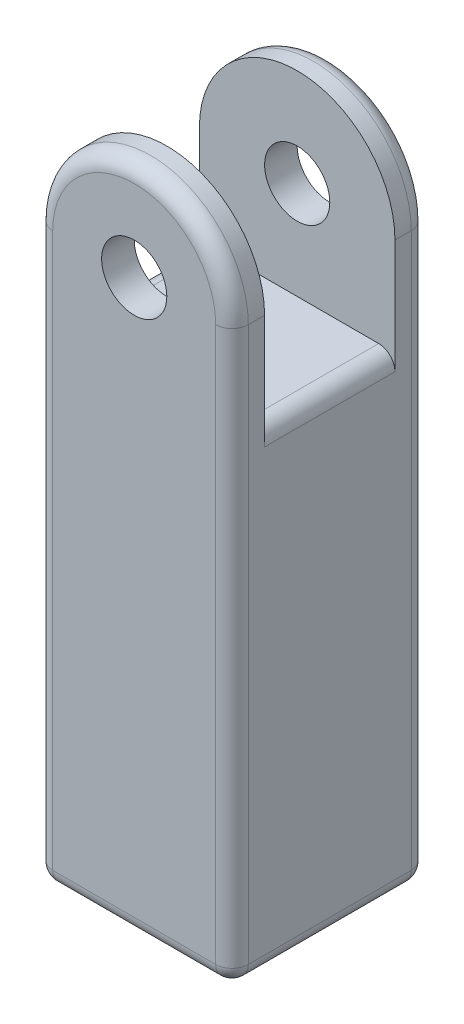
ISO-10303-21;
HEADER;
FILE_DESCRIPTION(('STEP AP214'),'2;1');
FILE_NAME('part.step','',(''),(''),'','','');
FILE_SCHEMA(('AUTOMOTIVE_DESIGN { 1 0 10303 214 1 1 1 1 }'));
ENDSEC;
DATA;
#1=APPLICATION_CONTEXT('core data for automotive mechanical design processes');
#2=APPLICATION_PROTOCOL_DEFINITION('international standard','automotive_design',2000,#1);
#3=PRODUCT_CONTEXT('',#1,'mechanical');
#4=PRODUCT('Part','Part','',(#3));
#5=PRODUCT_RELATED_PRODUCT_CATEGORY('part','',(#4));
#6=PRODUCT_DEFINITION_FORMATION('','',#4);
#7=PRODUCT_DEFINITION_CONTEXT('part definition',#1,'design');
#8=PRODUCT_DEFINITION('design','',#6,#7);
#9=PRODUCT_DEFINITION_SHAPE('','',#8);
#10=(LENGTH_UNIT() NAMED_UNIT(*) SI_UNIT(.MILLI.,.METRE.));
#11=(NAMED_UNIT(*) PLANE_ANGLE_UNIT() SI_UNIT($,.RADIAN.));
#12=(NAMED_UNIT(*) SI_UNIT($,.STERADIAN.) SOLID_ANGLE_UNIT());
#13=UNCERTAINTY_MEASURE_WITH_UNIT(LENGTH_MEASURE(1.E-05),#10,'distance_accuracy_value','');
#14=(GEOMETRIC_REPRESENTATION_CONTEXT(3) GLOBAL_UNCERTAINTY_ASSIGNED_CONTEXT((#13)) GLOBAL_UNIT_ASSIGNED_CONTEXT((#10,
#11,#12)) REPRESENTATION_CONTEXT('',''));
#15=CARTESIAN_POINT('',(0.,0.,0.));
#16=DIRECTION('',(0.,0.,1.));
#17=DIRECTION('',(1.,0.,0.));
#18=AXIS2_PLACEMENT_3D('',#15,#16,#17);
#19=CARTESIAN_POINT('',(0.,175.,-111.394102980499));
#20=DIRECTION('',(0.,0.,1.));
#21=DIRECTION('',(1.,0.,0.));
#22=AXIS2_PLACEMENT_3D('',#19,#20,#21);
#23=CYLINDRICAL_SURFACE('',#22,30.);
#24=DIRECTION('',(0.,0.,1.));
#25=VECTOR('',#24,1.);
#26=CARTESIAN_POINT('',(30.,175.,-111.394102980499));
#27=LINE('',#26,#25);
#28=CARTESIAN_POINT('',(30.,175.,-25.));
#29=VERTEX_POINT('',#28);
#30=CARTESIAN_POINT('',(30.,175.,-20.));
#31=VERTEX_POINT('',#30);
#32=EDGE_CURVE('E175',#29,#31,#27,.T.);
#33=ORIENTED_EDGE('',*,*,#32,.F.);
#34=CARTESIAN_POINT('',(0.,175.,-25.));
#35=DIRECTION('',(0.,0.,1.));
#36=DIRECTION('',(1.,0.,0.));
#37=AXIS2_PLACEMENT_3D('',#34,#35,#36);
#38=CIRCLE('',#37,30.);
#39=CARTESIAN_POINT('',(-30.,175.,-25.));
#40=VERTEX_POINT('',#39);
#41=EDGE_CURVE('E227',#29,#40,#38,.T.);
#42=ORIENTED_EDGE('',*,*,#41,.T.);
#43=DIRECTION('',(0.,0.,1.));
#44=VECTOR('',#43,1.);
#45=CARTESIAN_POINT('',(-30.,175.,-111.394102980499));
#46=LINE('',#45,#44);
#47=CARTESIAN_POINT('',(-30.,175.,-20.));
#48=VERTEX_POINT('',#47);
#49=EDGE_CURVE('E174',#40,#48,#46,.T.);
#50=ORIENTED_EDGE('',*,*,#49,.T.);
#51=CARTESIAN_POINT('',(0.,175.,-20.));
#52=DIRECTION('',(0.,0.,-1.));
#53=DIRECTION('',(-1.,0.,0.));
#54=AXIS2_PLACEMENT_3D('',#51,#52,#53);
#55=CIRCLE('',#54,30.);
#56=EDGE_CURVE('E197',#31,#48,#55,.F.);
#57=ORIENTED_EDGE('',*,*,#56,.F.);
#58=EDGE_LOOP('',(#33,#42,#50,#57));
#59=FACE_BOUND('',#58,.T.);
#60=ADVANCED_FACE('F33',(#59),#23,.T.);
#61=CARTESIAN_POINT('',(0.,175.,-111.394102980499));
#62=DIRECTION('',(0.,0.,1.));
#63=DIRECTION('',(1.,0.,0.));
#64=AXIS2_PLACEMENT_3D('',#61,#62,#63);
#65=CYLINDRICAL_SURFACE('',#64,10.);
#66=CARTESIAN_POINT('',(0.,175.,-20.));
#67=DIRECTION('',(0.,0.,-1.));
#68=DIRECTION('',(-1.,0.,0.));
#69=AXIS2_PLACEMENT_3D('',#66,#67,#68);
#70=CIRCLE('',#69,10.);
#71=CARTESIAN_POINT('',(-10.,175.,-20.));
#72=VERTEX_POINT('',#71);
#73=EDGE_CURVE('E168',#72,#72,#70,.F.);
#74=ORIENTED_EDGE('',*,*,#73,.T.);
#75=EDGE_LOOP('',(#74));
#76=FACE_BOUND('',#75,.T.);
#77=CARTESIAN_POINT('',(0.,175.,-30.));
#78=DIRECTION('',(0.,0.,1.));
#79=DIRECTION('',(1.,0.,0.));
#80=AXIS2_PLACEMENT_3D('',#77,#78,#79);
#81=CIRCLE('',#80,10.);
#82=CARTESIAN_POINT('',(10.,175.,-30.));
#83=VERTEX_POINT('',#82);
#84=EDGE_CURVE('E177',#83,#83,#81,.F.);
#85=ORIENTED_EDGE('',*,*,#84,.T.);
#86=EDGE_LOOP('',(#85));
#87=FACE_BOUND('',#86,.T.);
#88=ADVANCED_FACE('F373',(#76,#87),#65,.F.);
#89=CARTESIAN_POINT('',(30.,150.,-30.));
#90=DIRECTION('',(-1.,0.,0.));
#91=DIRECTION('',(0.,0.,1.));
#92=AXIS2_PLACEMENT_3D('',#89,#90,#91);
#93=PLANE('',#92);
#94=DIRECTION('',(0.,0.,1.));
#95=VECTOR('',#94,1.);
#96=CARTESIAN_POINT('',(30.,140.,-30.));
#97=LINE('',#96,#95);
#98=CARTESIAN_POINT('',(30.,140.,-20.));
#99=VERTEX_POINT('',#98);
#100=CARTESIAN_POINT('',(30.,140.,20.));
#101=VERTEX_POINT('',#100);
#102=EDGE_CURVE('E204',#99,#101,#97,.T.);
#103=ORIENTED_EDGE('',*,*,#102,.T.);
#104=DIRECTION('',(0.,1.,0.));
#105=VECTOR('',#104,1.);
#106=CARTESIAN_POINT('',(30.,205.,20.));
#107=LINE('',#106,#105);
#108=CARTESIAN_POINT('',(30.,175.,20.));
#109=VERTEX_POINT('',#108);
#110=EDGE_CURVE('E308',#101,#109,#107,.T.);
#111=ORIENTED_EDGE('',*,*,#110,.T.);
#112=CARTESIAN_POINT('',(30.,175.,25.));
#113=VERTEX_POINT('',#112);
#114=EDGE_CURVE('E167',#109,#113,#27,.T.);
#115=ORIENTED_EDGE('',*,*,#114,.T.);
#116=DIRECTION('',(0.,-1.,0.));
#117=VECTOR('',#116,1.);
#118=CARTESIAN_POINT('',(30.,150.,25.));
#119=LINE('',#118,#117);
#120=CARTESIAN_POINT('',(30.,5.,25.));
#121=VERTEX_POINT('',#120);
#122=EDGE_CURVE('E201',#113,#121,#119,.T.);
#123=ORIENTED_EDGE('',*,*,#122,.T.);
#124=DIRECTION('',(0.,0.,-1.));
#125=VECTOR('',#124,1.);
#126=CARTESIAN_POINT('',(30.,5.,-30.));
#127=LINE('',#126,#125);
#128=CARTESIAN_POINT('',(30.,5.,-25.));
#129=VERTEX_POINT('',#128);
#130=EDGE_CURVE('E189',#121,#129,#127,.T.);
#131=ORIENTED_EDGE('',*,*,#130,.T.);
#132=DIRECTION('',(0.,-1.,0.));
#133=VECTOR('',#132,1.);
#134=CARTESIAN_POINT('',(30.,150.,-25.));
#135=LINE('',#134,#133);
#136=EDGE_CURVE('E199',#129,#29,#135,.F.);
#137=ORIENTED_EDGE('',*,*,#136,.T.);
#138=ORIENTED_EDGE('',*,*,#32,.T.);
#139=DIRECTION('',(0.,-1.,0.));
#140=VECTOR('',#139,1.);
#141=CARTESIAN_POINT('',(30.,205.,-20.));
#142=LINE('',#141,#140);
#143=EDGE_CURVE('E157',#31,#99,#142,.T.);
#144=ORIENTED_EDGE('',*,*,#143,.T.);
#145=EDGE_LOOP('',(#103,#111,#115,#123,#131,#137,#138,#144));
#146=FACE_BOUND('',#145,.T.);
#147=ADVANCED_FACE('F320',(#146),#93,.F.);
#148=CARTESIAN_POINT('',(-30.,150.,-30.));
#149=DIRECTION('',(0.,0.,1.));
#150=DIRECTION('',(1.,0.,0.));
#151=AXIS2_PLACEMENT_3D('',#148,#149,#150);
#152=PLANE('',#151);
#153=CARTESIAN_POINT('',(0.,175.,-30.));
#154=DIRECTION('',(0.,0.,1.));
#155=DIRECTION('',(1.,0.,0.));
#156=AXIS2_PLACEMENT_3D('',#153,#154,#155);
#157=CIRCLE('',#156,25.);
#158=CARTESIAN_POINT('',(-25.,175.,-30.));
#159=VERTEX_POINT('',#158);
#160=CARTESIAN_POINT('',(25.,175.,-30.));
#161=VERTEX_POINT('',#160);
#162=EDGE_CURVE('E222',#159,#161,#157,.F.);
#163=ORIENTED_EDGE('',*,*,#162,.T.);
#164=DIRECTION('',(0.,-1.,0.));
#165=VECTOR('',#164,1.);
#166=CARTESIAN_POINT('',(25.,150.,-30.));
#167=LINE('',#166,#165);
#168=CARTESIAN_POINT('',(25.,5.,-30.));
#169=VERTEX_POINT('',#168);
#170=EDGE_CURVE('E224',#161,#169,#167,.T.);
#171=ORIENTED_EDGE('',*,*,#170,.T.);
#172=DIRECTION('',(-1.,0.,0.));
#173=VECTOR('',#172,1.);
#174=CARTESIAN_POINT('',(-30.,5.,-30.));
#175=LINE('',#174,#173);
#176=CARTESIAN_POINT('',(-25.,5.,-30.));
#177=VERTEX_POINT('',#176);
#178=EDGE_CURVE('E220',#169,#177,#175,.T.);
#179=ORIENTED_EDGE('',*,*,#178,.T.);
#180=DIRECTION('',(0.,-1.,0.));
#181=VECTOR('',#180,1.);
#182=CARTESIAN_POINT('',(-25.,150.,-30.));
#183=LINE('',#182,#181);
#184=EDGE_CURVE('E218',#177,#159,#183,.F.);
#185=ORIENTED_EDGE('',*,*,#184,.T.);
#186=EDGE_LOOP('',(#163,#171,#179,#185));
#187=FACE_BOUND('',#186,.T.);
#188=ORIENTED_EDGE('',*,*,#84,.F.);
#189=EDGE_LOOP('',(#188));
#190=FACE_BOUND('',#189,.T.);
#191=ADVANCED_FACE('F407',(#187,#190),#152,.F.);
#192=CARTESIAN_POINT('',(-30.,150.,-30.));
#193=DIRECTION('',(1.,0.,0.));
#194=DIRECTION('',(0.,0.,-1.));
#195=AXIS2_PLACEMENT_3D('',#192,#193,#194);
#196=PLANE('',#195);
#197=DIRECTION('',(0.,1.,0.));
#198=VECTOR('',#197,1.);
#199=CARTESIAN_POINT('',(-30.,205.,20.));
#200=LINE('',#199,#198);
#201=CARTESIAN_POINT('',(-30.,140.,20.));
#202=VERTEX_POINT('',#201);
#203=CARTESIAN_POINT('',(-30.,175.,20.));
#204=VERTEX_POINT('',#203);
#205=EDGE_CURVE('E146',#202,#204,#200,.T.);
#206=ORIENTED_EDGE('',*,*,#205,.F.);
#207=DIRECTION('',(0.,0.,1.));
#208=VECTOR('',#207,1.);
#209=CARTESIAN_POINT('',(-30.,140.,-30.));
#210=LINE('',#209,#208);
#211=CARTESIAN_POINT('',(-30.,140.,-20.));
#212=VERTEX_POINT('',#211);
#213=EDGE_CURVE('E243',#202,#212,#210,.F.);
#214=ORIENTED_EDGE('',*,*,#213,.T.);
#215=DIRECTION('',(0.,-1.,0.));
#216=VECTOR('',#215,1.);
#217=CARTESIAN_POINT('',(-30.,205.,-20.));
#218=LINE('',#217,#216);
#219=EDGE_CURVE('E158',#48,#212,#218,.T.);
#220=ORIENTED_EDGE('',*,*,#219,.F.);
#221=ORIENTED_EDGE('',*,*,#49,.F.);
#222=DIRECTION('',(0.,-1.,0.));
#223=VECTOR('',#222,1.);
#224=CARTESIAN_POINT('',(-30.,150.,-25.));
#225=LINE('',#224,#223);
#226=CARTESIAN_POINT('',(-30.,5.,-25.));
#227=VERTEX_POINT('',#226);
#228=EDGE_CURVE('E240',#40,#227,#225,.T.);
#229=ORIENTED_EDGE('',*,*,#228,.T.);
#230=DIRECTION('',(0.,0.,1.));
#231=VECTOR('',#230,1.);
#232=CARTESIAN_POINT('',(-30.,5.,-30.));
#233=LINE('',#232,#231);
#234=CARTESIAN_POINT('',(-30.,5.,25.));
#235=VERTEX_POINT('',#234);
#236=EDGE_CURVE('E238',#227,#235,#233,.T.);
#237=ORIENTED_EDGE('',*,*,#236,.T.);
#238=DIRECTION('',(0.,-1.,0.));
#239=VECTOR('',#238,1.);
#240=CARTESIAN_POINT('',(-30.,150.,25.));
#241=LINE('',#240,#239);
#242=CARTESIAN_POINT('',(-30.,175.,25.));
#243=VERTEX_POINT('',#242);
#244=EDGE_CURVE('E173',#235,#243,#241,.F.);
#245=ORIENTED_EDGE('',*,*,#244,.T.);
#246=EDGE_CURVE('E164',#204,#243,#46,.T.);
#247=ORIENTED_EDGE('',*,*,#246,.F.);
#248=EDGE_LOOP('',(#206,#214,#220,#221,#229,#237,#245,#247));
#249=FACE_BOUND('',#248,.T.);
#250=ADVANCED_FACE('F171',(#249),#196,.F.);
#251=CARTESIAN_POINT('',(-30.,150.,30.));
#252=DIRECTION('',(0.,0.,-1.));
#253=DIRECTION('',(-1.,0.,0.));
#254=AXIS2_PLACEMENT_3D('',#251,#252,#253);
#255=PLANE('',#254);
#256=DIRECTION('',(1.,0.,0.));
#257=VECTOR('',#256,1.);
#258=CARTESIAN_POINT('',(-30.,5.,30.));
#259=LINE('',#258,#257);
#260=CARTESIAN_POINT('',(-25.,5.,30.));
#261=VERTEX_POINT('',#260);
#262=CARTESIAN_POINT('',(25.,5.,30.));
#263=VERTEX_POINT('',#262);
#264=EDGE_CURVE('E209',#261,#263,#259,.T.);
#265=ORIENTED_EDGE('',*,*,#264,.T.);
#266=DIRECTION('',(0.,-1.,0.));
#267=VECTOR('',#266,1.);
#268=CARTESIAN_POINT('',(25.,150.,30.));
#269=LINE('',#268,#267);
#270=CARTESIAN_POINT('',(25.,175.,30.));
#271=VERTEX_POINT('',#270);
#272=EDGE_CURVE('E213',#263,#271,#269,.F.);
#273=ORIENTED_EDGE('',*,*,#272,.T.);
#274=CARTESIAN_POINT('',(0.,175.,30.));
#275=DIRECTION('',(0.,0.,-1.));
#276=DIRECTION('',(-1.,0.,0.));
#277=AXIS2_PLACEMENT_3D('',#274,#275,#276);
#278=CIRCLE('',#277,25.);
#279=CARTESIAN_POINT('',(-25.,175.,30.));
#280=VERTEX_POINT('',#279);
#281=EDGE_CURVE('E211',#271,#280,#278,.F.);
#282=ORIENTED_EDGE('',*,*,#281,.T.);
#283=DIRECTION('',(0.,-1.,0.));
#284=VECTOR('',#283,1.);
#285=CARTESIAN_POINT('',(-25.,150.,30.));
#286=LINE('',#285,#284);
#287=EDGE_CURVE('E207',#280,#261,#286,.T.);
#288=ORIENTED_EDGE('',*,*,#287,.T.);
#289=EDGE_LOOP('',(#265,#273,#282,#288));
#290=FACE_BOUND('',#289,.T.);
#291=CARTESIAN_POINT('',(0.,175.,30.));
#292=DIRECTION('',(0.,0.,1.));
#293=DIRECTION('',(1.,0.,0.));
#294=AXIS2_PLACEMENT_3D('',#291,#292,#293);
#295=CIRCLE('',#294,10.);
#296=CARTESIAN_POINT('',(10.,175.,30.));
#297=VERTEX_POINT('',#296);
#298=EDGE_CURVE('E180',#297,#297,#295,.T.);
#299=ORIENTED_EDGE('',*,*,#298,.F.);
#300=EDGE_LOOP('',(#299));
#301=FACE_BOUND('',#300,.T.);
#302=ADVANCED_FACE('F401',(#290,#301),#255,.F.);
#303=CARTESIAN_POINT('',(0.,0.,0.));
#304=DIRECTION('',(0.,1.,0.));
#305=DIRECTION('',(0.,0.,1.));
#306=AXIS2_PLACEMENT_3D('',#303,#304,#305);
#307=PLANE('',#306);
#308=DIRECTION('',(-1.,0.,0.));
#309=VECTOR('',#308,1.);
#310=CARTESIAN_POINT('',(0.,0.,-25.));
#311=LINE('',#310,#309);
#312=CARTESIAN_POINT('',(-25.,0.,-25.));
#313=VERTEX_POINT('',#312);
#314=CARTESIAN_POINT('',(25.,0.,-25.));
#315=VERTEX_POINT('',#314);
#316=EDGE_CURVE('E233',#313,#315,#311,.F.);
#317=ORIENTED_EDGE('',*,*,#316,.T.);
#318=DIRECTION('',(0.,0.,-1.));
#319=VECTOR('',#318,1.);
#320=CARTESIAN_POINT('',(25.,0.,0.));
#321=LINE('',#320,#319);
#322=CARTESIAN_POINT('',(25.,0.,25.));
#323=VERTEX_POINT('',#322);
#324=EDGE_CURVE('E236',#315,#323,#321,.F.);
#325=ORIENTED_EDGE('',*,*,#324,.T.);
#326=DIRECTION('',(1.,0.,0.));
#327=VECTOR('',#326,1.);
#328=CARTESIAN_POINT('',(0.,0.,25.));
#329=LINE('',#328,#327);
#330=CARTESIAN_POINT('',(-25.,0.,25.));
#331=VERTEX_POINT('',#330);
#332=EDGE_CURVE('E231',#323,#331,#329,.F.);
#333=ORIENTED_EDGE('',*,*,#332,.T.);
#334=DIRECTION('',(0.,0.,1.));
#335=VECTOR('',#334,1.);
#336=CARTESIAN_POINT('',(-25.,0.,0.));
#337=LINE('',#336,#335);
#338=EDGE_CURVE('E229',#331,#313,#337,.F.);
#339=ORIENTED_EDGE('',*,*,#338,.T.);
#340=EDGE_LOOP('',(#317,#325,#333,#339));
#341=FACE_BOUND('',#340,.T.);
#342=CARTESIAN_POINT('',(0.,0.,0.));
#343=DIRECTION('',(0.,-1.,0.));
#344=DIRECTION('',(0.,0.,-1.));
#345=AXIS2_PLACEMENT_3D('',#342,#343,#344);
#346=CIRCLE('',#345,15.);
#347=CARTESIAN_POINT('',(0.,0.,-15.));
#348=VERTEX_POINT('',#347);
#349=EDGE_CURVE('E185',#348,#348,#346,.T.);
#350=ORIENTED_EDGE('',*,*,#349,.F.);
#351=EDGE_LOOP('',(#350));
#352=FACE_BOUND('',#351,.T.);
#353=ADVANCED_FACE('F353',(#341,#352),#307,.F.);
#354=CARTESIAN_POINT('',(0.,30.,0.));
#355=DIRECTION('',(0.,-1.,0.));
#356=DIRECTION('',(0.,0.,-1.));
#357=AXIS2_PLACEMENT_3D('',#354,#355,#356);
#358=CYLINDRICAL_SURFACE('',#357,15.);
#359=CARTESIAN_POINT('',(0.,30.,0.));
#360=DIRECTION('',(0.,-1.,0.));
#361=DIRECTION('',(0.,0.,-1.));
#362=AXIS2_PLACEMENT_3D('',#359,#360,#361);
#363=CIRCLE('',#362,15.);
#364=CARTESIAN_POINT('',(0.,30.,-15.));
#365=VERTEX_POINT('',#364);
#366=EDGE_CURVE('E186',#365,#365,#363,.T.);
#367=ORIENTED_EDGE('',*,*,#366,.F.);
#368=EDGE_LOOP('',(#367));
#369=FACE_BOUND('',#368,.T.);
#370=ORIENTED_EDGE('',*,*,#349,.T.);
#371=EDGE_LOOP('',(#370));
#372=FACE_BOUND('',#371,.T.);
#373=ADVANCED_FACE('F391',(#369,#372),#358,.F.);
#374=CARTESIAN_POINT('',(0.,30.,0.));
#375=DIRECTION('',(0.,-1.,0.));
#376=DIRECTION('',(0.,0.,-1.));
#377=AXIS2_PLACEMENT_3D('',#374,#375,#376);
#378=PLANE('',#377);
#379=ORIENTED_EDGE('',*,*,#366,.T.);
#380=EDGE_LOOP('',(#379));
#381=FACE_BOUND('',#380,.T.);
#382=ADVANCED_FACE('F384',(#381),#378,.T.);
#383=ORIENTED_EDGE('',*,*,#246,.T.);
#384=CARTESIAN_POINT('',(0.,175.,25.));
#385=DIRECTION('',(0.,0.,-1.));
#386=DIRECTION('',(-1.,0.,0.));
#387=AXIS2_PLACEMENT_3D('',#384,#385,#386);
#388=CIRCLE('',#387,30.);
#389=EDGE_CURVE('E216',#243,#113,#388,.T.);
#390=ORIENTED_EDGE('',*,*,#389,.T.);
#391=ORIENTED_EDGE('',*,*,#114,.F.);
#392=CARTESIAN_POINT('',(0.,175.,20.));
#393=DIRECTION('',(0.,0.,1.));
#394=DIRECTION('',(1.,0.,0.));
#395=AXIS2_PLACEMENT_3D('',#392,#393,#394);
#396=CIRCLE('',#395,30.);
#397=EDGE_CURVE('E150',#204,#109,#396,.F.);
#398=ORIENTED_EDGE('',*,*,#397,.F.);
#399=EDGE_LOOP('',(#383,#390,#391,#398));
#400=FACE_BOUND('',#399,.T.);
#401=ADVANCED_FACE('F163',(#400),#23,.T.);
#402=CARTESIAN_POINT('',(0.,175.,20.));
#403=DIRECTION('',(0.,0.,1.));
#404=DIRECTION('',(1.,0.,0.));
#405=AXIS2_PLACEMENT_3D('',#402,#403,#404);
#406=CIRCLE('',#405,10.);
#407=CARTESIAN_POINT('',(10.,175.,20.));
#408=VERTEX_POINT('',#407);
#409=EDGE_CURVE('E169',#408,#408,#406,.F.);
#410=ORIENTED_EDGE('',*,*,#409,.T.);
#411=EDGE_LOOP('',(#410));
#412=FACE_BOUND('',#411,.T.);
#413=ORIENTED_EDGE('',*,*,#298,.T.);
#414=EDGE_LOOP('',(#413));
#415=FACE_BOUND('',#414,.T.);
#416=ADVANCED_FACE('F381',(#412,#415),#65,.F.);
#417=CARTESIAN_POINT('',(30.,205.,-20.));
#418=DIRECTION('',(0.,0.,-1.));
#419=DIRECTION('',(-1.,0.,0.));
#420=AXIS2_PLACEMENT_3D('',#417,#418,#419);
#421=PLANE('',#420);
#422=ORIENTED_EDGE('',*,*,#56,.T.);
#423=ORIENTED_EDGE('',*,*,#219,.T.);
#424=CARTESIAN_POINT('',(-25.,140.,-20.));
#425=DIRECTION('',(0.,0.,-1.));
#426=DIRECTION('',(-1.,0.,0.));
#427=AXIS2_PLACEMENT_3D('',#424,#425,#426);
#428=CIRCLE('',#427,5.);
#429=CARTESIAN_POINT('',(-25.,145.,-20.));
#430=VERTEX_POINT('',#429);
#431=EDGE_CURVE('E11',#212,#430,#428,.T.);
#432=ORIENTED_EDGE('',*,*,#431,.T.);
#433=DIRECTION('',(-1.,0.,0.));
#434=VECTOR('',#433,1.);
#435=CARTESIAN_POINT('',(30.,145.,-20.));
#436=LINE('',#435,#434);
#437=CARTESIAN_POINT('',(25.,145.,-20.));
#438=VERTEX_POINT('',#437);
#439=EDGE_CURVE('E312',#438,#430,#436,.T.);
#440=ORIENTED_EDGE('',*,*,#439,.F.);
#441=CARTESIAN_POINT('',(25.,140.,-20.));
#442=DIRECTION('',(0.,0.,-1.));
#443=DIRECTION('',(-1.,0.,0.));
#444=AXIS2_PLACEMENT_3D('',#441,#442,#443);
#445=CIRCLE('',#444,5.);
#446=EDGE_CURVE('E251',#438,#99,#445,.T.);
#447=ORIENTED_EDGE('',*,*,#446,.T.);
#448=ORIENTED_EDGE('',*,*,#143,.F.);
#449=EDGE_LOOP('',(#422,#423,#432,#440,#447,#448));
#450=FACE_BOUND('',#449,.T.);
#451=ORIENTED_EDGE('',*,*,#73,.F.);
#452=EDGE_LOOP('',(#451));
#453=FACE_BOUND('',#452,.T.);
#454=ADVANCED_FACE('F389',(#450,#453),#421,.F.);
#455=CARTESIAN_POINT('',(30.,205.,20.));
#456=DIRECTION('',(0.,0.,1.));
#457=DIRECTION('',(1.,0.,0.));
#458=AXIS2_PLACEMENT_3D('',#455,#456,#457);
#459=PLANE('',#458);
#460=ORIENTED_EDGE('',*,*,#397,.T.);
#461=ORIENTED_EDGE('',*,*,#110,.F.);
#462=CARTESIAN_POINT('',(25.,140.,20.));
#463=DIRECTION('',(0.,0.,1.));
#464=DIRECTION('',(1.,0.,0.));
#465=AXIS2_PLACEMENT_3D('',#462,#463,#464);
#466=CIRCLE('',#465,5.);
#467=CARTESIAN_POINT('',(25.,145.,20.));
#468=VERTEX_POINT('',#467);
#469=EDGE_CURVE('E249',#101,#468,#466,.T.);
#470=ORIENTED_EDGE('',*,*,#469,.T.);
#471=DIRECTION('',(-1.,0.,0.));
#472=VECTOR('',#471,1.);
#473=CARTESIAN_POINT('',(30.,145.,20.));
#474=LINE('',#473,#472);
#475=CARTESIAN_POINT('',(-25.,145.,20.));
#476=VERTEX_POINT('',#475);
#477=EDGE_CURVE('E194',#468,#476,#474,.T.);
#478=ORIENTED_EDGE('',*,*,#477,.T.);
#479=CARTESIAN_POINT('',(-25.,140.,20.));
#480=DIRECTION('',(0.,0.,1.));
#481=DIRECTION('',(1.,0.,0.));
#482=AXIS2_PLACEMENT_3D('',#479,#480,#481);
#483=CIRCLE('',#482,5.);
#484=EDGE_CURVE('E42',#476,#202,#483,.T.);
#485=ORIENTED_EDGE('',*,*,#484,.T.);
#486=ORIENTED_EDGE('',*,*,#205,.T.);
#487=EDGE_LOOP('',(#460,#461,#470,#478,#485,#486));
#488=FACE_BOUND('',#487,.T.);
#489=ORIENTED_EDGE('',*,*,#409,.F.);
#490=EDGE_LOOP('',(#489));
#491=FACE_BOUND('',#490,.T.);
#492=ADVANCED_FACE('F148',(#488,#491),#459,.F.);
#493=CARTESIAN_POINT('',(30.,145.,-20.));
#494=DIRECTION('',(0.,-1.,0.));
#495=DIRECTION('',(0.,0.,-1.));
#496=AXIS2_PLACEMENT_3D('',#493,#494,#495);
#497=PLANE('',#496);
#498=ORIENTED_EDGE('',*,*,#477,.F.);
#499=DIRECTION('',(0.,0.,1.));
#500=VECTOR('',#499,1.);
#501=CARTESIAN_POINT('',(25.,145.,-20.));
#502=LINE('',#501,#500);
#503=EDGE_CURVE('E55',#468,#438,#502,.F.);
#504=ORIENTED_EDGE('',*,*,#503,.T.);
#505=ORIENTED_EDGE('',*,*,#439,.T.);
#506=DIRECTION('',(0.,0.,1.));
#507=VECTOR('',#506,1.);
#508=CARTESIAN_POINT('',(-25.,145.,-20.));
#509=LINE('',#508,#507);
#510=EDGE_CURVE('E245',#430,#476,#509,.T.);
#511=ORIENTED_EDGE('',*,*,#510,.T.);
#512=EDGE_LOOP('',(#498,#504,#505,#511));
#513=FACE_BOUND('',#512,.T.);
#514=ADVANCED_FACE('F536',(#513),#497,.F.);
#515=CARTESIAN_POINT('',(-25.,150.,-25.));
#516=DIRECTION('',(0.,-1.,0.));
#517=DIRECTION('',(0.,0.,-1.));
#518=AXIS2_PLACEMENT_3D('',#515,#516,#517);
#519=CYLINDRICAL_SURFACE('',#518,5.);
#520=CARTESIAN_POINT('',(-25.,5.,-25.));
#521=DIRECTION('',(0.,-1.,0.));
#522=DIRECTION('',(0.,0.,-1.));
#523=AXIS2_PLACEMENT_3D('',#520,#521,#522);
#524=CIRCLE('',#523,5.);
#525=EDGE_CURVE('E293',#227,#177,#524,.T.);
#526=ORIENTED_EDGE('',*,*,#525,.F.);
#527=ORIENTED_EDGE('',*,*,#228,.F.);
#528=CARTESIAN_POINT('',(-25.,175.,-25.));
#529=DIRECTION('',(0.,1.,0.));
#530=DIRECTION('',(0.,0.,1.));
#531=AXIS2_PLACEMENT_3D('',#528,#529,#530);
#532=CIRCLE('',#531,5.);
#533=EDGE_CURVE('E37',#159,#40,#532,.T.);
#534=ORIENTED_EDGE('',*,*,#533,.F.);
#535=ORIENTED_EDGE('',*,*,#184,.F.);
#536=EDGE_LOOP('',(#526,#527,#534,#535));
#537=FACE_BOUND('',#536,.T.);
#538=ADVANCED_FACE('F370',(#537),#519,.T.);
#539=CARTESIAN_POINT('',(0.,175.,-25.));
#540=DIRECTION('',(0.,0.,1.));
#541=DIRECTION('',(1.,0.,0.));
#542=AXIS2_PLACEMENT_3D('',#539,#540,#541);
#543=TOROIDAL_SURFACE('',#542,25.,5.);
#544=ORIENTED_EDGE('',*,*,#533,.T.);
#545=ORIENTED_EDGE('',*,*,#41,.F.);
#546=CARTESIAN_POINT('',(25.,175.,-25.));
#547=DIRECTION('',(0.,-1.,0.));
#548=DIRECTION('',(0.,0.,-1.));
#549=AXIS2_PLACEMENT_3D('',#546,#547,#548);
#550=CIRCLE('',#549,5.);
#551=EDGE_CURVE('E291',#161,#29,#550,.T.);
#552=ORIENTED_EDGE('',*,*,#551,.F.);
#553=ORIENTED_EDGE('',*,*,#162,.F.);
#554=EDGE_LOOP('',(#544,#545,#552,#553));
#555=FACE_BOUND('',#554,.T.);
#556=ADVANCED_FACE('F363',(#555),#543,.T.);
#557=CARTESIAN_POINT('',(-25.,5.,-25.));
#558=DIRECTION('',(0.,0.,1.));
#559=DIRECTION('',(1.,0.,0.));
#560=AXIS2_PLACEMENT_3D('',#557,#558,#559);
#561=SPHERICAL_SURFACE('',#560,5.);
#562=CARTESIAN_POINT('',(-25.,5.,-25.));
#563=DIRECTION('',(0.,0.,-1.));
#564=DIRECTION('',(-1.,0.,0.));
#565=AXIS2_PLACEMENT_3D('',#562,#563,#564);
#566=CIRCLE('',#565,5.);
#567=EDGE_CURVE('E285',#227,#313,#566,.F.);
#568=ORIENTED_EDGE('',*,*,#567,.F.);
#569=ORIENTED_EDGE('',*,*,#525,.T.);
#570=CARTESIAN_POINT('',(-25.,5.,-25.));
#571=DIRECTION('',(-1.,0.,0.));
#572=DIRECTION('',(0.,0.,1.));
#573=AXIS2_PLACEMENT_3D('',#570,#571,#572);
#574=CIRCLE('',#573,5.);
#575=EDGE_CURVE('E288',#313,#177,#574,.F.);
#576=ORIENTED_EDGE('',*,*,#575,.F.);
#577=EDGE_LOOP('',(#568,#569,#576));
#578=FACE_BOUND('',#577,.T.);
#579=ADVANCED_FACE('F361',(#578),#561,.T.);
#580=CARTESIAN_POINT('',(25.,150.,-25.));
#581=DIRECTION('',(0.,-1.,0.));
#582=DIRECTION('',(0.,0.,-1.));
#583=AXIS2_PLACEMENT_3D('',#580,#581,#582);
#584=CYLINDRICAL_SURFACE('',#583,5.);
#585=ORIENTED_EDGE('',*,*,#551,.T.);
#586=ORIENTED_EDGE('',*,*,#136,.F.);
#587=CARTESIAN_POINT('',(25.,5.,-25.));
#588=DIRECTION('',(0.,-1.,0.));
#589=DIRECTION('',(0.,0.,-1.));
#590=AXIS2_PLACEMENT_3D('',#587,#588,#589);
#591=CIRCLE('',#590,5.);
#592=EDGE_CURVE('E282',#169,#129,#591,.T.);
#593=ORIENTED_EDGE('',*,*,#592,.F.);
#594=ORIENTED_EDGE('',*,*,#170,.F.);
#595=EDGE_LOOP('',(#585,#586,#593,#594));
#596=FACE_BOUND('',#595,.T.);
#597=ADVANCED_FACE('F342',(#596),#584,.T.);
#598=CARTESIAN_POINT('',(-30.,5.,-25.));
#599=DIRECTION('',(-1.,0.,0.));
#600=DIRECTION('',(0.,0.,1.));
#601=AXIS2_PLACEMENT_3D('',#598,#599,#600);
#602=CYLINDRICAL_SURFACE('',#601,5.);
#603=ORIENTED_EDGE('',*,*,#575,.T.);
#604=ORIENTED_EDGE('',*,*,#178,.F.);
#605=CARTESIAN_POINT('',(25.,5.,-25.));
#606=DIRECTION('',(1.,0.,0.));
#607=DIRECTION('',(0.,0.,-1.));
#608=AXIS2_PLACEMENT_3D('',#605,#606,#607);
#609=CIRCLE('',#608,5.);
#610=EDGE_CURVE('E280',#315,#169,#609,.T.);
#611=ORIENTED_EDGE('',*,*,#610,.F.);
#612=ORIENTED_EDGE('',*,*,#316,.F.);
#613=EDGE_LOOP('',(#603,#604,#611,#612));
#614=FACE_BOUND('',#613,.T.);
#615=ADVANCED_FACE('F351',(#614),#602,.T.);
#616=CARTESIAN_POINT('',(-25.,5.,-30.));
#617=DIRECTION('',(0.,0.,1.));
#618=DIRECTION('',(1.,0.,0.));
#619=AXIS2_PLACEMENT_3D('',#616,#617,#618);
#620=CYLINDRICAL_SURFACE('',#619,5.);
#621=ORIENTED_EDGE('',*,*,#567,.T.);
#622=ORIENTED_EDGE('',*,*,#338,.F.);
#623=CARTESIAN_POINT('',(-25.,5.,25.));
#624=DIRECTION('',(0.,0.,1.));
#625=DIRECTION('',(1.,0.,0.));
#626=AXIS2_PLACEMENT_3D('',#623,#624,#625);
#627=CIRCLE('',#626,5.);
#628=EDGE_CURVE('E277',#235,#331,#627,.T.);
#629=ORIENTED_EDGE('',*,*,#628,.F.);
#630=ORIENTED_EDGE('',*,*,#236,.F.);
#631=EDGE_LOOP('',(#621,#622,#629,#630));
#632=FACE_BOUND('',#631,.T.);
#633=ADVANCED_FACE('F360',(#632),#620,.T.);
#634=CARTESIAN_POINT('',(25.,5.,-25.));
#635=DIRECTION('',(0.,0.,1.));
#636=DIRECTION('',(1.,0.,0.));
#637=AXIS2_PLACEMENT_3D('',#634,#635,#636);
#638=SPHERICAL_SURFACE('',#637,5.);
#639=ORIENTED_EDGE('',*,*,#610,.T.);
#640=ORIENTED_EDGE('',*,*,#592,.T.);
#641=CARTESIAN_POINT('',(25.,5.,-25.));
#642=DIRECTION('',(0.,0.,-1.));
#643=DIRECTION('',(-1.,0.,0.));
#644=AXIS2_PLACEMENT_3D('',#641,#642,#643);
#645=CIRCLE('',#644,5.);
#646=EDGE_CURVE('E271',#315,#129,#645,.F.);
#647=ORIENTED_EDGE('',*,*,#646,.F.);
#648=EDGE_LOOP('',(#639,#640,#647));
#649=FACE_BOUND('',#648,.T.);
#650=ADVANCED_FACE('F347',(#649),#638,.T.);
#651=CARTESIAN_POINT('',(-25.,5.,25.));
#652=DIRECTION('',(0.,0.,1.));
#653=DIRECTION('',(1.,0.,0.));
#654=AXIS2_PLACEMENT_3D('',#651,#652,#653);
#655=SPHERICAL_SURFACE('',#654,5.);
#656=CARTESIAN_POINT('',(-25.,5.,25.));
#657=DIRECTION('',(-1.,0.,0.));
#658=DIRECTION('',(0.,0.,1.));
#659=AXIS2_PLACEMENT_3D('',#656,#657,#658);
#660=CIRCLE('',#659,5.);
#661=EDGE_CURVE('E268',#261,#331,#660,.F.);
#662=ORIENTED_EDGE('',*,*,#661,.F.);
#663=CARTESIAN_POINT('',(-25.,5.,25.));
#664=DIRECTION('',(0.,-1.,0.));
#665=DIRECTION('',(0.,0.,-1.));
#666=AXIS2_PLACEMENT_3D('',#663,#664,#665);
#667=CIRCLE('',#666,5.);
#668=EDGE_CURVE('E274',#235,#261,#667,.F.);
#669=ORIENTED_EDGE('',*,*,#668,.F.);
#670=ORIENTED_EDGE('',*,*,#628,.T.);
#671=EDGE_LOOP('',(#662,#669,#670));
#672=FACE_BOUND('',#671,.T.);
#673=ADVANCED_FACE('F429',(#672),#655,.T.);
#674=CARTESIAN_POINT('',(-25.,150.,25.));
#675=DIRECTION('',(0.,-1.,0.));
#676=DIRECTION('',(0.,0.,-1.));
#677=AXIS2_PLACEMENT_3D('',#674,#675,#676);
#678=CYLINDRICAL_SURFACE('',#677,5.);
#679=ORIENTED_EDGE('',*,*,#668,.T.);
#680=ORIENTED_EDGE('',*,*,#287,.F.);
#681=CARTESIAN_POINT('',(-25.,175.,25.));
#682=DIRECTION('',(0.,1.,0.));
#683=DIRECTION('',(0.,0.,1.));
#684=AXIS2_PLACEMENT_3D('',#681,#682,#683);
#685=CIRCLE('',#684,5.);
#686=EDGE_CURVE('E265',#243,#280,#685,.T.);
#687=ORIENTED_EDGE('',*,*,#686,.F.);
#688=ORIENTED_EDGE('',*,*,#244,.F.);
#689=EDGE_LOOP('',(#679,#680,#687,#688));
#690=FACE_BOUND('',#689,.T.);
#691=ADVANCED_FACE('F426',(#690),#678,.T.);
#692=CARTESIAN_POINT('',(25.,5.,-30.));
#693=DIRECTION('',(0.,0.,-1.));
#694=DIRECTION('',(-1.,0.,0.));
#695=AXIS2_PLACEMENT_3D('',#692,#693,#694);
#696=CYLINDRICAL_SURFACE('',#695,5.);
#697=ORIENTED_EDGE('',*,*,#646,.T.);
#698=ORIENTED_EDGE('',*,*,#130,.F.);
#699=CARTESIAN_POINT('',(25.,5.,25.));
#700=DIRECTION('',(0.,0.,1.));
#701=DIRECTION('',(1.,0.,0.));
#702=AXIS2_PLACEMENT_3D('',#699,#700,#701);
#703=CIRCLE('',#702,5.);
#704=EDGE_CURVE('E262',#323,#121,#703,.T.);
#705=ORIENTED_EDGE('',*,*,#704,.F.);
#706=ORIENTED_EDGE('',*,*,#324,.F.);
#707=EDGE_LOOP('',(#697,#698,#705,#706));
#708=FACE_BOUND('',#707,.T.);
#709=ADVANCED_FACE('F336',(#708),#696,.T.);
#710=CARTESIAN_POINT('',(-30.,5.,25.));
#711=DIRECTION('',(1.,0.,0.));
#712=DIRECTION('',(0.,0.,-1.));
#713=AXIS2_PLACEMENT_3D('',#710,#711,#712);
#714=CYLINDRICAL_SURFACE('',#713,5.);
#715=ORIENTED_EDGE('',*,*,#661,.T.);
#716=ORIENTED_EDGE('',*,*,#332,.F.);
#717=CARTESIAN_POINT('',(25.,5.,25.));
#718=DIRECTION('',(1.,0.,0.));
#719=DIRECTION('',(0.,0.,-1.));
#720=AXIS2_PLACEMENT_3D('',#717,#718,#719);
#721=CIRCLE('',#720,5.);
#722=EDGE_CURVE('E259',#263,#323,#721,.T.);
#723=ORIENTED_EDGE('',*,*,#722,.F.);
#724=ORIENTED_EDGE('',*,*,#264,.F.);
#725=EDGE_LOOP('',(#715,#716,#723,#724));
#726=FACE_BOUND('',#725,.T.);
#727=ADVANCED_FACE('F420',(#726),#714,.T.);
#728=CARTESIAN_POINT('',(0.,175.,25.));
#729=DIRECTION('',(0.,0.,-1.));
#730=DIRECTION('',(-1.,0.,0.));
#731=AXIS2_PLACEMENT_3D('',#728,#729,#730);
#732=TOROIDAL_SURFACE('',#731,25.,5.);
#733=ORIENTED_EDGE('',*,*,#686,.T.);
#734=ORIENTED_EDGE('',*,*,#281,.F.);
#735=CARTESIAN_POINT('',(25.,175.,25.));
#736=DIRECTION('',(0.,-1.,0.));
#737=DIRECTION('',(0.,0.,-1.));
#738=AXIS2_PLACEMENT_3D('',#735,#736,#737);
#739=CIRCLE('',#738,5.);
#740=EDGE_CURVE('E257',#113,#271,#739,.T.);
#741=ORIENTED_EDGE('',*,*,#740,.F.);
#742=ORIENTED_EDGE('',*,*,#389,.F.);
#743=EDGE_LOOP('',(#733,#734,#741,#742));
#744=FACE_BOUND('',#743,.T.);
#745=ADVANCED_FACE('F325',(#744),#732,.T.);
#746=CARTESIAN_POINT('',(25.,5.,25.));
#747=DIRECTION('',(0.,0.,1.));
#748=DIRECTION('',(1.,0.,0.));
#749=AXIS2_PLACEMENT_3D('',#746,#747,#748);
#750=SPHERICAL_SURFACE('',#749,5.);
#751=ORIENTED_EDGE('',*,*,#722,.T.);
#752=ORIENTED_EDGE('',*,*,#704,.T.);
#753=CARTESIAN_POINT('',(25.,5.,25.));
#754=DIRECTION('',(0.,-1.,0.));
#755=DIRECTION('',(0.,0.,-1.));
#756=AXIS2_PLACEMENT_3D('',#753,#754,#755);
#757=CIRCLE('',#756,5.);
#758=EDGE_CURVE('E255',#263,#121,#757,.F.);
#759=ORIENTED_EDGE('',*,*,#758,.F.);
#760=EDGE_LOOP('',(#751,#752,#759));
#761=FACE_BOUND('',#760,.T.);
#762=ADVANCED_FACE('F333',(#761),#750,.T.);
#763=CARTESIAN_POINT('',(25.,150.,25.));
#764=DIRECTION('',(0.,-1.,0.));
#765=DIRECTION('',(0.,0.,-1.));
#766=AXIS2_PLACEMENT_3D('',#763,#764,#765);
#767=CYLINDRICAL_SURFACE('',#766,5.);
#768=ORIENTED_EDGE('',*,*,#740,.T.);
#769=ORIENTED_EDGE('',*,*,#272,.F.);
#770=ORIENTED_EDGE('',*,*,#758,.T.);
#771=ORIENTED_EDGE('',*,*,#122,.F.);
#772=EDGE_LOOP('',(#768,#769,#770,#771));
#773=FACE_BOUND('',#772,.T.);
#774=ADVANCED_FACE('F328',(#773),#767,.T.);
#775=CARTESIAN_POINT('',(25.,140.,-30.));
#776=DIRECTION('',(0.,0.,1.));
#777=DIRECTION('',(1.,0.,0.));
#778=AXIS2_PLACEMENT_3D('',#775,#776,#777);
#779=CYLINDRICAL_SURFACE('',#778,5.);
#780=ORIENTED_EDGE('',*,*,#446,.F.);
#781=ORIENTED_EDGE('',*,*,#503,.F.);
#782=ORIENTED_EDGE('',*,*,#469,.F.);
#783=ORIENTED_EDGE('',*,*,#102,.F.);
#784=EDGE_LOOP('',(#780,#781,#782,#783));
#785=FACE_BOUND('',#784,.T.);
#786=ADVANCED_FACE('F415',(#785),#779,.T.);
#787=CARTESIAN_POINT('',(-25.,140.,-20.));
#788=DIRECTION('',(0.,0.,1.));
#789=DIRECTION('',(1.,0.,0.));
#790=AXIS2_PLACEMENT_3D('',#787,#788,#789);
#791=CYLINDRICAL_SURFACE('',#790,5.);
#792=ORIENTED_EDGE('',*,*,#431,.F.);
#793=ORIENTED_EDGE('',*,*,#213,.F.);
#794=ORIENTED_EDGE('',*,*,#484,.F.);
#795=ORIENTED_EDGE('',*,*,#510,.F.);
#796=EDGE_LOOP('',(#792,#793,#794,#795));
#797=FACE_BOUND('',#796,.T.);
#798=ADVANCED_FACE('F35',(#797),#791,.T.);
#799=CLOSED_SHELL('',(#60,#88,#147,#191,#250,#302,#353,#373,#382,#401,#416,#454,#492,#514,#538,
#556,#579,#597,#615,#633,#650,#673,#691,#709,#727,#745,#762,#774,#786,#798));
#800=MANIFOLD_SOLID_BREP('B2',#799);
#801=ADVANCED_BREP_SHAPE_REPRESENTATION('',(#18,#800),#14);
#802=SHAPE_DEFINITION_REPRESENTATION(#9,#801);
ENDSEC;
END-ISO-10303-21;
